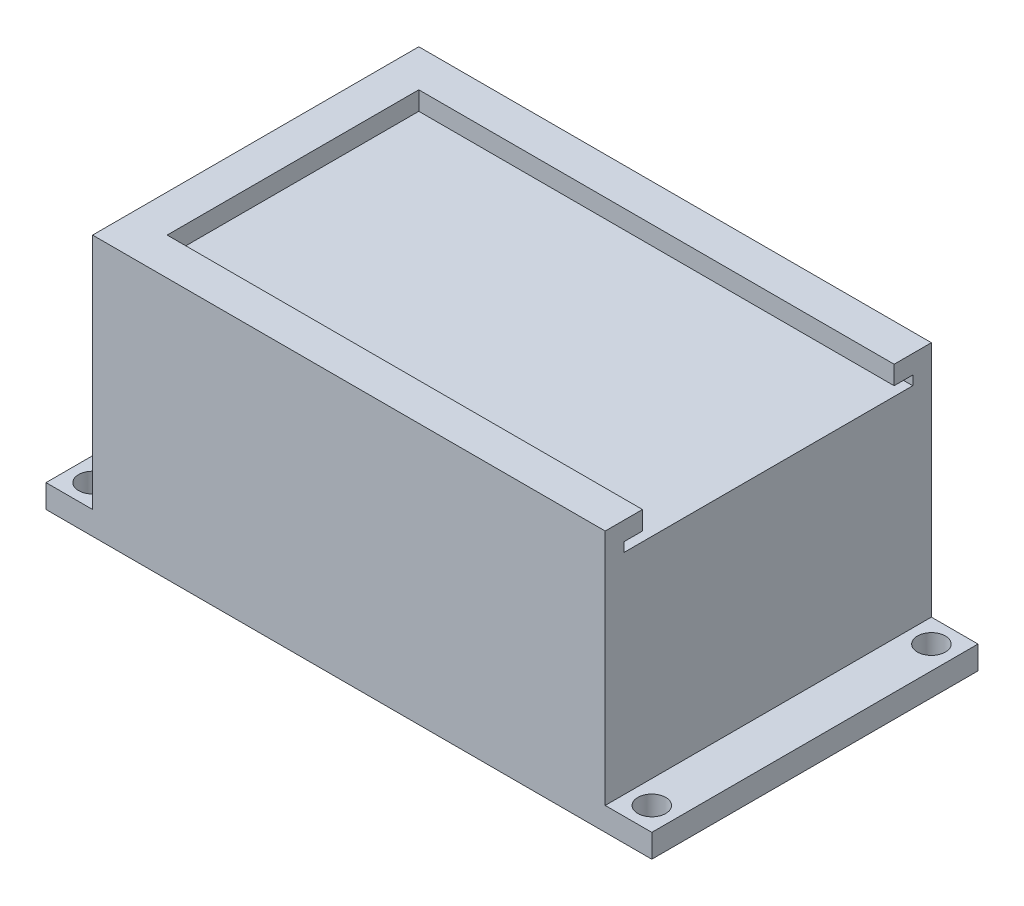
ISO-10303-21;
HEADER;
FILE_DESCRIPTION(('STEP AP214'),'2;1');
FILE_NAME('part.step','',(''),(''),'','','');
FILE_SCHEMA(('AUTOMOTIVE_DESIGN { 1 0 10303 214 1 1 1 1 }'));
ENDSEC;
DATA;
#1=APPLICATION_CONTEXT('core data for automotive mechanical design processes');
#2=APPLICATION_PROTOCOL_DEFINITION('international standard','automotive_design',2000,#1);
#3=PRODUCT_CONTEXT('',#1,'mechanical');
#4=PRODUCT('Part','Part','',(#3));
#5=PRODUCT_RELATED_PRODUCT_CATEGORY('part','',(#4));
#6=PRODUCT_DEFINITION_FORMATION('','',#4);
#7=PRODUCT_DEFINITION_CONTEXT('part definition',#1,'design');
#8=PRODUCT_DEFINITION('design','',#6,#7);
#9=PRODUCT_DEFINITION_SHAPE('','',#8);
#10=(LENGTH_UNIT() NAMED_UNIT(*) SI_UNIT(.MILLI.,.METRE.));
#11=(NAMED_UNIT(*) PLANE_ANGLE_UNIT() SI_UNIT($,.RADIAN.));
#12=(NAMED_UNIT(*) SI_UNIT($,.STERADIAN.) SOLID_ANGLE_UNIT());
#13=UNCERTAINTY_MEASURE_WITH_UNIT(LENGTH_MEASURE(1.E-05),#10,'distance_accuracy_value','');
#14=(GEOMETRIC_REPRESENTATION_CONTEXT(3) GLOBAL_UNCERTAINTY_ASSIGNED_CONTEXT((#13)) GLOBAL_UNIT_ASSIGNED_CONTEXT((#10,
#11,#12)) REPRESENTATION_CONTEXT('',''));
#15=CARTESIAN_POINT('',(0.,0.,0.));
#16=DIRECTION('',(0.,0.,1.));
#17=DIRECTION('',(1.,0.,0.));
#18=AXIS2_PLACEMENT_3D('',#15,#16,#17);
#19=CARTESIAN_POINT('',(0.,63.5,0.));
#20=DIRECTION('',(0.,1.,0.));
#21=DIRECTION('',(0.,0.,1.));
#22=AXIS2_PLACEMENT_3D('',#19,#20,#21);
#23=PLANE('',#22);
#24=DIRECTION('',(0.,0.,-1.));
#25=VECTOR('',#24,1.);
#26=CARTESIAN_POINT('',(-147.32,63.5,0.));
#27=LINE('',#26,#25);
#28=CARTESIAN_POINT('',(-147.32,63.5,-5.08));
#29=VERTEX_POINT('',#28);
#30=CARTESIAN_POINT('',(-147.32,63.5,-83.82));
#31=VERTEX_POINT('',#30);
#32=EDGE_CURVE('E53',#29,#31,#27,.T.);
#33=ORIENTED_EDGE('',*,*,#32,.F.);
#34=DIRECTION('',(1.,0.,0.));
#35=VECTOR('',#34,1.);
#36=CARTESIAN_POINT('',(0.,63.5,-5.08));
#37=LINE('',#36,#35);
#38=CARTESIAN_POINT('',(-12.7,63.5,-5.08));
#39=VERTEX_POINT('',#38);
#40=EDGE_CURVE('E243',#29,#39,#37,.T.);
#41=ORIENTED_EDGE('',*,*,#40,.T.);
#42=DIRECTION('',(0.,0.,-1.));
#43=VECTOR('',#42,1.);
#44=CARTESIAN_POINT('',(-12.7,63.5,-88.9));
#45=LINE('',#44,#43);
#46=CARTESIAN_POINT('',(-12.7,63.5,-83.82));
#47=VERTEX_POINT('',#46);
#48=EDGE_CURVE('E294',#39,#47,#45,.T.);
#49=ORIENTED_EDGE('',*,*,#48,.T.);
#50=DIRECTION('',(1.,0.,0.));
#51=VECTOR('',#50,1.);
#52=CARTESIAN_POINT('',(0.,63.5,-83.82));
#53=LINE('',#52,#51);
#54=EDGE_CURVE('E58',#31,#47,#53,.T.);
#55=ORIENTED_EDGE('',*,*,#54,.F.);
#56=EDGE_LOOP('',(#33,#41,#49,#55));
#57=FACE_BOUND('',#56,.T.);
#58=ADVANCED_FACE('F38',(#57),#23,.T.);
#59=CARTESIAN_POINT('',(0.,6.35,0.));
#60=DIRECTION('',(0.,1.,0.));
#61=DIRECTION('',(0.,0.,1.));
#62=AXIS2_PLACEMENT_3D('',#59,#60,#61);
#63=PLANE('',#62);
#64=DIRECTION('',(0.,0.,1.));
#65=VECTOR('',#64,1.);
#66=CARTESIAN_POINT('',(-152.4,6.35,-88.9));
#67=LINE('',#66,#65);
#68=CARTESIAN_POINT('',(-152.4,6.35,-88.9));
#69=VERTEX_POINT('',#68);
#70=CARTESIAN_POINT('',(-152.4,6.35,0.));
#71=VERTEX_POINT('',#70);
#72=EDGE_CURVE('E287',#69,#71,#67,.T.);
#73=ORIENTED_EDGE('',*,*,#72,.F.);
#74=DIRECTION('',(-1.,0.,0.));
#75=VECTOR('',#74,1.);
#76=CARTESIAN_POINT('',(-165.1,6.35,-88.9));
#77=LINE('',#76,#75);
#78=CARTESIAN_POINT('',(-165.1,6.35,-88.9));
#79=VERTEX_POINT('',#78);
#80=EDGE_CURVE('E338',#69,#79,#77,.T.);
#81=ORIENTED_EDGE('',*,*,#80,.T.);
#82=DIRECTION('',(0.,0.,1.));
#83=VECTOR('',#82,1.);
#84=CARTESIAN_POINT('',(-165.1,6.35,-88.9));
#85=LINE('',#84,#83);
#86=CARTESIAN_POINT('',(-165.1,6.35,0.));
#87=VERTEX_POINT('',#86);
#88=EDGE_CURVE('E329',#79,#87,#85,.T.);
#89=ORIENTED_EDGE('',*,*,#88,.T.);
#90=DIRECTION('',(1.,0.,0.));
#91=VECTOR('',#90,1.);
#92=CARTESIAN_POINT('',(-165.1,6.35,0.));
#93=LINE('',#92,#91);
#94=EDGE_CURVE('E334',#87,#71,#93,.T.);
#95=ORIENTED_EDGE('',*,*,#94,.T.);
#96=EDGE_LOOP('',(#73,#81,#89,#95));
#97=FACE_BOUND('',#96,.T.);
#98=CARTESIAN_POINT('',(-158.75,6.35,-82.55));
#99=DIRECTION('',(0.,1.,0.));
#100=DIRECTION('',(0.,0.,1.));
#101=AXIS2_PLACEMENT_3D('',#98,#99,#100);
#102=CIRCLE('',#101,3.81000000000001);
#103=CARTESIAN_POINT('',(-158.75,6.35,-78.74));
#104=VERTEX_POINT('',#103);
#105=EDGE_CURVE('E317',#104,#104,#102,.T.);
#106=ORIENTED_EDGE('',*,*,#105,.F.);
#107=EDGE_LOOP('',(#106));
#108=FACE_BOUND('',#107,.T.);
#109=CARTESIAN_POINT('',(-158.75,6.35,-6.35));
#110=DIRECTION('',(0.,1.,0.));
#111=DIRECTION('',(0.,0.,1.));
#112=AXIS2_PLACEMENT_3D('',#109,#110,#111);
#113=CIRCLE('',#112,3.81000000000001);
#114=CARTESIAN_POINT('',(-158.75,6.35,-2.53999999999999));
#115=VERTEX_POINT('',#114);
#116=EDGE_CURVE('E323',#115,#115,#113,.T.);
#117=ORIENTED_EDGE('',*,*,#116,.F.);
#118=EDGE_LOOP('',(#117));
#119=FACE_BOUND('',#118,.T.);
#120=ADVANCED_FACE('F372',(#97,#108,#119),#63,.T.);
#121=DIRECTION('',(0.,0.,-1.));
#122=VECTOR('',#121,1.);
#123=CARTESIAN_POINT('',(-12.7,6.35,-88.9));
#124=LINE('',#123,#122);
#125=CARTESIAN_POINT('',(-12.7,6.35,0.));
#126=VERTEX_POINT('',#125);
#127=CARTESIAN_POINT('',(-12.7,6.35,-88.9));
#128=VERTEX_POINT('',#127);
#129=EDGE_CURVE('E182',#126,#128,#124,.T.);
#130=ORIENTED_EDGE('',*,*,#129,.F.);
#131=CARTESIAN_POINT('',(0.,6.35,0.));
#132=VERTEX_POINT('',#131);
#133=EDGE_CURVE('E332',#126,#132,#93,.T.);
#134=ORIENTED_EDGE('',*,*,#133,.T.);
#135=DIRECTION('',(0.,0.,-1.));
#136=VECTOR('',#135,1.);
#137=CARTESIAN_POINT('',(0.,6.35,-88.9));
#138=LINE('',#137,#136);
#139=CARTESIAN_POINT('',(0.,6.35,-88.9));
#140=VERTEX_POINT('',#139);
#141=EDGE_CURVE('E336',#132,#140,#138,.T.);
#142=ORIENTED_EDGE('',*,*,#141,.T.);
#143=EDGE_CURVE('E339',#140,#128,#77,.T.);
#144=ORIENTED_EDGE('',*,*,#143,.T.);
#145=EDGE_LOOP('',(#130,#134,#142,#144));
#146=FACE_BOUND('',#145,.T.);
#147=CARTESIAN_POINT('',(-6.35,6.35,-82.55));
#148=DIRECTION('',(0.,1.,0.));
#149=DIRECTION('',(0.,0.,1.));
#150=AXIS2_PLACEMENT_3D('',#147,#148,#149);
#151=CIRCLE('',#150,3.81);
#152=CARTESIAN_POINT('',(-6.35,6.35,-78.74));
#153=VERTEX_POINT('',#152);
#154=EDGE_CURVE('E311',#153,#153,#151,.T.);
#155=ORIENTED_EDGE('',*,*,#154,.F.);
#156=EDGE_LOOP('',(#155));
#157=FACE_BOUND('',#156,.T.);
#158=CARTESIAN_POINT('',(-6.34999999999999,6.35,-6.35));
#159=DIRECTION('',(0.,1.,0.));
#160=DIRECTION('',(0.,0.,1.));
#161=AXIS2_PLACEMENT_3D('',#158,#159,#160);
#162=CIRCLE('',#161,3.81);
#163=CARTESIAN_POINT('',(-6.34999999999999,6.35,-2.54));
#164=VERTEX_POINT('',#163);
#165=EDGE_CURVE('E305',#164,#164,#162,.T.);
#166=ORIENTED_EDGE('',*,*,#165,.F.);
#167=EDGE_LOOP('',(#166));
#168=FACE_BOUND('',#167,.T.);
#169=ADVANCED_FACE('F410',(#146,#157,#168),#63,.T.);
#170=CARTESIAN_POINT('',(0.,0.,0.));
#171=DIRECTION('',(0.,1.,0.));
#172=DIRECTION('',(0.,0.,1.));
#173=AXIS2_PLACEMENT_3D('',#170,#171,#172);
#174=PLANE('',#173);
#175=DIRECTION('',(-1.,0.,0.));
#176=VECTOR('',#175,1.);
#177=CARTESIAN_POINT('',(-25.4,0.,-12.7));
#178=LINE('',#177,#176);
#179=CARTESIAN_POINT('',(-25.4,0.,-12.7));
#180=VERTEX_POINT('',#179);
#181=CARTESIAN_POINT('',(-139.7,0.,-12.7));
#182=VERTEX_POINT('',#181);
#183=EDGE_CURVE('E277',#180,#182,#178,.T.);
#184=ORIENTED_EDGE('',*,*,#183,.F.);
#185=DIRECTION('',(0.,0.,1.));
#186=VECTOR('',#185,1.);
#187=CARTESIAN_POINT('',(-25.4,0.,-76.2));
#188=LINE('',#187,#186);
#189=CARTESIAN_POINT('',(-25.4,0.,-76.2));
#190=VERTEX_POINT('',#189);
#191=EDGE_CURVE('E261',#190,#180,#188,.T.);
#192=ORIENTED_EDGE('',*,*,#191,.F.);
#193=DIRECTION('',(1.,0.,0.));
#194=VECTOR('',#193,1.);
#195=CARTESIAN_POINT('',(-25.4,0.,-76.2));
#196=LINE('',#195,#194);
#197=CARTESIAN_POINT('',(-139.7,0.,-76.2));
#198=VERTEX_POINT('',#197);
#199=EDGE_CURVE('E266',#198,#190,#196,.T.);
#200=ORIENTED_EDGE('',*,*,#199,.F.);
#201=DIRECTION('',(0.,0.,-1.));
#202=VECTOR('',#201,1.);
#203=CARTESIAN_POINT('',(-139.7,0.,-76.2));
#204=LINE('',#203,#202);
#205=EDGE_CURVE('E280',#182,#198,#204,.T.);
#206=ORIENTED_EDGE('',*,*,#205,.F.);
#207=EDGE_LOOP('',(#184,#192,#200,#206));
#208=FACE_BOUND('',#207,.T.);
#209=DIRECTION('',(0.,0.,1.));
#210=VECTOR('',#209,1.);
#211=CARTESIAN_POINT('',(-165.1,0.,-88.9));
#212=LINE('',#211,#210);
#213=CARTESIAN_POINT('',(-165.1,0.,-88.9));
#214=VERTEX_POINT('',#213);
#215=CARTESIAN_POINT('',(-165.1,0.,0.));
#216=VERTEX_POINT('',#215);
#217=EDGE_CURVE('E326',#214,#216,#212,.T.);
#218=ORIENTED_EDGE('',*,*,#217,.F.);
#219=DIRECTION('',(-1.,0.,0.));
#220=VECTOR('',#219,1.);
#221=CARTESIAN_POINT('',(-165.1,0.,-88.9));
#222=LINE('',#221,#220);
#223=CARTESIAN_POINT('',(0.,0.,-88.9));
#224=VERTEX_POINT('',#223);
#225=EDGE_CURVE('E333',#224,#214,#222,.T.);
#226=ORIENTED_EDGE('',*,*,#225,.F.);
#227=DIRECTION('',(0.,0.,-1.));
#228=VECTOR('',#227,1.);
#229=CARTESIAN_POINT('',(0.,0.,-88.9));
#230=LINE('',#229,#228);
#231=CARTESIAN_POINT('',(0.,0.,0.));
#232=VERTEX_POINT('',#231);
#233=EDGE_CURVE('E346',#232,#224,#230,.T.);
#234=ORIENTED_EDGE('',*,*,#233,.F.);
#235=DIRECTION('',(1.,0.,0.));
#236=VECTOR('',#235,1.);
#237=CARTESIAN_POINT('',(-165.1,0.,0.));
#238=LINE('',#237,#236);
#239=EDGE_CURVE('E344',#216,#232,#238,.T.);
#240=ORIENTED_EDGE('',*,*,#239,.F.);
#241=EDGE_LOOP('',(#218,#226,#234,#240));
#242=FACE_BOUND('',#241,.T.);
#243=CARTESIAN_POINT('',(-158.75,0.,-6.35));
#244=DIRECTION('',(0.,1.,0.));
#245=DIRECTION('',(0.,0.,1.));
#246=AXIS2_PLACEMENT_3D('',#243,#244,#245);
#247=CIRCLE('',#246,3.81000000000001);
#248=CARTESIAN_POINT('',(-158.75,0.,-2.53999999999999));
#249=VERTEX_POINT('',#248);
#250=EDGE_CURVE('E320',#249,#249,#247,.T.);
#251=ORIENTED_EDGE('',*,*,#250,.T.);
#252=EDGE_LOOP('',(#251));
#253=FACE_BOUND('',#252,.T.);
#254=CARTESIAN_POINT('',(-158.75,0.,-82.55));
#255=DIRECTION('',(0.,1.,0.));
#256=DIRECTION('',(0.,0.,1.));
#257=AXIS2_PLACEMENT_3D('',#254,#255,#256);
#258=CIRCLE('',#257,3.81000000000001);
#259=CARTESIAN_POINT('',(-158.75,0.,-78.74));
#260=VERTEX_POINT('',#259);
#261=EDGE_CURVE('E314',#260,#260,#258,.T.);
#262=ORIENTED_EDGE('',*,*,#261,.T.);
#263=EDGE_LOOP('',(#262));
#264=FACE_BOUND('',#263,.T.);
#265=CARTESIAN_POINT('',(-6.35,0.,-82.55));
#266=DIRECTION('',(0.,1.,0.));
#267=DIRECTION('',(0.,0.,1.));
#268=AXIS2_PLACEMENT_3D('',#265,#266,#267);
#269=CIRCLE('',#268,3.81);
#270=CARTESIAN_POINT('',(-6.35,0.,-78.74));
#271=VERTEX_POINT('',#270);
#272=EDGE_CURVE('E308',#271,#271,#269,.T.);
#273=ORIENTED_EDGE('',*,*,#272,.T.);
#274=EDGE_LOOP('',(#273));
#275=FACE_BOUND('',#274,.T.);
#276=CARTESIAN_POINT('',(-6.34999999999999,0.,-6.35));
#277=DIRECTION('',(0.,1.,0.));
#278=DIRECTION('',(0.,0.,1.));
#279=AXIS2_PLACEMENT_3D('',#276,#277,#278);
#280=CIRCLE('',#279,3.81);
#281=CARTESIAN_POINT('',(-6.34999999999999,0.,-2.54));
#282=VERTEX_POINT('',#281);
#283=EDGE_CURVE('E304',#282,#282,#280,.T.);
#284=ORIENTED_EDGE('',*,*,#283,.T.);
#285=EDGE_LOOP('',(#284));
#286=FACE_BOUND('',#285,.T.);
#287=ADVANCED_FACE('F365',(#208,#242,#253,#264,#275,#286),#174,.F.);
#288=CARTESIAN_POINT('',(-165.1,6.35,-88.9));
#289=DIRECTION('',(1.,0.,0.));
#290=DIRECTION('',(0.,0.,-1.));
#291=AXIS2_PLACEMENT_3D('',#288,#289,#290);
#292=PLANE('',#291);
#293=ORIENTED_EDGE('',*,*,#217,.T.);
#294=DIRECTION('',(0.,-1.,0.));
#295=VECTOR('',#294,1.);
#296=CARTESIAN_POINT('',(-165.1,6.35,0.));
#297=LINE('',#296,#295);
#298=EDGE_CURVE('E11',#87,#216,#297,.T.);
#299=ORIENTED_EDGE('',*,*,#298,.F.);
#300=ORIENTED_EDGE('',*,*,#88,.F.);
#301=DIRECTION('',(0.,-1.,0.));
#302=VECTOR('',#301,1.);
#303=CARTESIAN_POINT('',(-165.1,6.35,-88.9));
#304=LINE('',#303,#302);
#305=EDGE_CURVE('E341',#79,#214,#304,.T.);
#306=ORIENTED_EDGE('',*,*,#305,.T.);
#307=EDGE_LOOP('',(#293,#299,#300,#306));
#308=FACE_BOUND('',#307,.T.);
#309=ADVANCED_FACE('F40',(#308),#292,.F.);
#310=CARTESIAN_POINT('',(-165.1,6.35,0.));
#311=DIRECTION('',(0.,0.,-1.));
#312=DIRECTION('',(-1.,0.,0.));
#313=AXIS2_PLACEMENT_3D('',#310,#311,#312);
#314=PLANE('',#313);
#315=ORIENTED_EDGE('',*,*,#239,.T.);
#316=DIRECTION('',(0.,-1.,0.));
#317=VECTOR('',#316,1.);
#318=CARTESIAN_POINT('',(0.,6.35,0.));
#319=LINE('',#318,#317);
#320=EDGE_CURVE('E46',#132,#232,#319,.T.);
#321=ORIENTED_EDGE('',*,*,#320,.F.);
#322=ORIENTED_EDGE('',*,*,#133,.F.);
#323=DIRECTION('',(0.,-1.,0.));
#324=VECTOR('',#323,1.);
#325=CARTESIAN_POINT('',(-12.7,63.5,0.));
#326=LINE('',#325,#324);
#327=CARTESIAN_POINT('',(-12.7,71.12,0.));
#328=VERTEX_POINT('',#327);
#329=EDGE_CURVE('E185',#328,#126,#326,.T.);
#330=ORIENTED_EDGE('',*,*,#329,.F.);
#331=DIRECTION('',(1.,0.,0.));
#332=VECTOR('',#331,1.);
#333=CARTESIAN_POINT('',(0.,71.12,0.));
#334=LINE('',#333,#332);
#335=CARTESIAN_POINT('',(-152.4,71.12,0.));
#336=VERTEX_POINT('',#335);
#337=EDGE_CURVE('E208',#336,#328,#334,.T.);
#338=ORIENTED_EDGE('',*,*,#337,.F.);
#339=DIRECTION('',(0.,-1.,0.));
#340=VECTOR('',#339,1.);
#341=CARTESIAN_POINT('',(-152.4,63.5,0.));
#342=LINE('',#341,#340);
#343=EDGE_CURVE('E301',#336,#71,#342,.T.);
#344=ORIENTED_EDGE('',*,*,#343,.T.);
#345=ORIENTED_EDGE('',*,*,#94,.F.);
#346=ORIENTED_EDGE('',*,*,#298,.T.);
#347=EDGE_LOOP('',(#315,#321,#322,#330,#338,#344,#345,#346));
#348=FACE_BOUND('',#347,.T.);
#349=ADVANCED_FACE('F376',(#348),#314,.F.);
#350=CARTESIAN_POINT('',(0.,6.35,-88.9));
#351=DIRECTION('',(-1.,0.,0.));
#352=DIRECTION('',(0.,0.,1.));
#353=AXIS2_PLACEMENT_3D('',#350,#351,#352);
#354=PLANE('',#353);
#355=ORIENTED_EDGE('',*,*,#233,.T.);
#356=DIRECTION('',(0.,-1.,0.));
#357=VECTOR('',#356,1.);
#358=CARTESIAN_POINT('',(0.,6.35,-88.9));
#359=LINE('',#358,#357);
#360=EDGE_CURVE('E351',#140,#224,#359,.T.);
#361=ORIENTED_EDGE('',*,*,#360,.F.);
#362=ORIENTED_EDGE('',*,*,#141,.F.);
#363=ORIENTED_EDGE('',*,*,#320,.T.);
#364=EDGE_LOOP('',(#355,#361,#362,#363));
#365=FACE_BOUND('',#364,.T.);
#366=ADVANCED_FACE('F358',(#365),#354,.F.);
#367=CARTESIAN_POINT('',(-165.1,6.35,-88.9));
#368=DIRECTION('',(0.,0.,1.));
#369=DIRECTION('',(1.,0.,0.));
#370=AXIS2_PLACEMENT_3D('',#367,#368,#369);
#371=PLANE('',#370);
#372=ORIENTED_EDGE('',*,*,#225,.T.);
#373=ORIENTED_EDGE('',*,*,#305,.F.);
#374=ORIENTED_EDGE('',*,*,#80,.F.);
#375=DIRECTION('',(0.,-1.,0.));
#376=VECTOR('',#375,1.);
#377=CARTESIAN_POINT('',(-152.4,63.5,-88.9));
#378=LINE('',#377,#376);
#379=CARTESIAN_POINT('',(-152.4,71.12,-88.9));
#380=VERTEX_POINT('',#379);
#381=EDGE_CURVE('E186',#380,#69,#378,.T.);
#382=ORIENTED_EDGE('',*,*,#381,.F.);
#383=DIRECTION('',(-1.,0.,0.));
#384=VECTOR('',#383,1.);
#385=CARTESIAN_POINT('',(0.,71.12,-88.9));
#386=LINE('',#385,#384);
#387=CARTESIAN_POINT('',(-12.7,71.12,-88.9));
#388=VERTEX_POINT('',#387);
#389=EDGE_CURVE('E189',#388,#380,#386,.T.);
#390=ORIENTED_EDGE('',*,*,#389,.F.);
#391=DIRECTION('',(0.,-1.,0.));
#392=VECTOR('',#391,1.);
#393=CARTESIAN_POINT('',(-12.7,63.5,-88.9));
#394=LINE('',#393,#392);
#395=EDGE_CURVE('E175',#388,#128,#394,.T.);
#396=ORIENTED_EDGE('',*,*,#395,.T.);
#397=ORIENTED_EDGE('',*,*,#143,.F.);
#398=ORIENTED_EDGE('',*,*,#360,.T.);
#399=EDGE_LOOP('',(#372,#373,#374,#382,#390,#396,#397,#398));
#400=FACE_BOUND('',#399,.T.);
#401=ADVANCED_FACE('F190',(#400),#371,.F.);
#402=CARTESIAN_POINT('',(-158.75,6.35,-6.35));
#403=DIRECTION('',(0.,-1.,0.));
#404=DIRECTION('',(0.,0.,-1.));
#405=AXIS2_PLACEMENT_3D('',#402,#403,#404);
#406=CYLINDRICAL_SURFACE('',#405,3.81000000000001);
#407=ORIENTED_EDGE('',*,*,#116,.T.);
#408=EDGE_LOOP('',(#407));
#409=FACE_BOUND('',#408,.T.);
#410=ORIENTED_EDGE('',*,*,#250,.F.);
#411=EDGE_LOOP('',(#410));
#412=FACE_BOUND('',#411,.T.);
#413=ADVANCED_FACE('F431',(#409,#412),#406,.F.);
#414=CARTESIAN_POINT('',(-158.75,6.35,-82.55));
#415=DIRECTION('',(0.,-1.,0.));
#416=DIRECTION('',(0.,0.,-1.));
#417=AXIS2_PLACEMENT_3D('',#414,#415,#416);
#418=CYLINDRICAL_SURFACE('',#417,3.81000000000001);
#419=ORIENTED_EDGE('',*,*,#105,.T.);
#420=EDGE_LOOP('',(#419));
#421=FACE_BOUND('',#420,.T.);
#422=ORIENTED_EDGE('',*,*,#261,.F.);
#423=EDGE_LOOP('',(#422));
#424=FACE_BOUND('',#423,.T.);
#425=ADVANCED_FACE('F427',(#421,#424),#418,.F.);
#426=CARTESIAN_POINT('',(-6.35,6.35,-82.55));
#427=DIRECTION('',(0.,-1.,0.));
#428=DIRECTION('',(0.,0.,-1.));
#429=AXIS2_PLACEMENT_3D('',#426,#427,#428);
#430=CYLINDRICAL_SURFACE('',#429,3.81);
#431=ORIENTED_EDGE('',*,*,#154,.T.);
#432=EDGE_LOOP('',(#431));
#433=FACE_BOUND('',#432,.T.);
#434=ORIENTED_EDGE('',*,*,#272,.F.);
#435=EDGE_LOOP('',(#434));
#436=FACE_BOUND('',#435,.T.);
#437=ADVANCED_FACE('F423',(#433,#436),#430,.F.);
#438=CARTESIAN_POINT('',(-6.34999999999999,6.35,-6.35));
#439=DIRECTION('',(0.,-1.,0.));
#440=DIRECTION('',(0.,0.,-1.));
#441=AXIS2_PLACEMENT_3D('',#438,#439,#440);
#442=CYLINDRICAL_SURFACE('',#441,3.81);
#443=ORIENTED_EDGE('',*,*,#165,.T.);
#444=EDGE_LOOP('',(#443));
#445=FACE_BOUND('',#444,.T.);
#446=ORIENTED_EDGE('',*,*,#283,.F.);
#447=EDGE_LOOP('',(#446));
#448=FACE_BOUND('',#447,.T.);
#449=ADVANCED_FACE('F420',(#445,#448),#442,.F.);
#450=CARTESIAN_POINT('',(-152.4,63.5,-88.9));
#451=DIRECTION('',(1.,0.,0.));
#452=DIRECTION('',(0.,0.,-1.));
#453=AXIS2_PLACEMENT_3D('',#450,#451,#452);
#454=PLANE('',#453);
#455=ORIENTED_EDGE('',*,*,#72,.T.);
#456=ORIENTED_EDGE('',*,*,#343,.F.);
#457=DIRECTION('',(0.,0.,1.));
#458=VECTOR('',#457,1.);
#459=CARTESIAN_POINT('',(-152.4,71.12,0.));
#460=LINE('',#459,#458);
#461=EDGE_CURVE('E196',#380,#336,#460,.T.);
#462=ORIENTED_EDGE('',*,*,#461,.F.);
#463=ORIENTED_EDGE('',*,*,#381,.T.);
#464=EDGE_LOOP('',(#455,#456,#462,#463));
#465=FACE_BOUND('',#464,.T.);
#466=ADVANCED_FACE('F375',(#465),#454,.F.);
#467=CARTESIAN_POINT('',(-12.7,63.5,-88.9));
#468=DIRECTION('',(-1.,0.,0.));
#469=DIRECTION('',(0.,0.,1.));
#470=AXIS2_PLACEMENT_3D('',#467,#468,#469);
#471=PLANE('',#470);
#472=ORIENTED_EDGE('',*,*,#129,.T.);
#473=ORIENTED_EDGE('',*,*,#395,.F.);
#474=DIRECTION('',(0.,0.,-1.));
#475=VECTOR('',#474,1.);
#476=CARTESIAN_POINT('',(-12.7,71.12,0.));
#477=LINE('',#476,#475);
#478=CARTESIAN_POINT('',(-12.7,71.12,-78.74));
#479=VERTEX_POINT('',#478);
#480=EDGE_CURVE('E180',#479,#388,#477,.T.);
#481=ORIENTED_EDGE('',*,*,#480,.F.);
#482=DIRECTION('',(0.,-1.,0.));
#483=VECTOR('',#482,1.);
#484=CARTESIAN_POINT('',(-12.7,71.12,-78.74));
#485=LINE('',#484,#483);
#486=CARTESIAN_POINT('',(-12.7,66.04,-78.74));
#487=VERTEX_POINT('',#486);
#488=EDGE_CURVE('E222',#479,#487,#485,.T.);
#489=ORIENTED_EDGE('',*,*,#488,.T.);
#490=DIRECTION('',(0.,0.,-1.));
#491=VECTOR('',#490,1.);
#492=CARTESIAN_POINT('',(-12.7,66.04,0.));
#493=LINE('',#492,#491);
#494=CARTESIAN_POINT('',(-12.7,66.04,-83.82));
#495=VERTEX_POINT('',#494);
#496=EDGE_CURVE('E223',#487,#495,#493,.T.);
#497=ORIENTED_EDGE('',*,*,#496,.T.);
#498=DIRECTION('',(0.,-1.,0.));
#499=VECTOR('',#498,1.);
#500=CARTESIAN_POINT('',(-12.7,66.04,-83.82));
#501=LINE('',#500,#499);
#502=EDGE_CURVE('E256',#495,#47,#501,.T.);
#503=ORIENTED_EDGE('',*,*,#502,.T.);
#504=ORIENTED_EDGE('',*,*,#48,.F.);
#505=DIRECTION('',(0.,-1.,0.));
#506=VECTOR('',#505,1.);
#507=CARTESIAN_POINT('',(-12.7,66.04,-5.08));
#508=LINE('',#507,#506);
#509=CARTESIAN_POINT('',(-12.7,66.04,-5.08));
#510=VERTEX_POINT('',#509);
#511=EDGE_CURVE('E253',#510,#39,#508,.T.);
#512=ORIENTED_EDGE('',*,*,#511,.F.);
#513=CARTESIAN_POINT('',(-12.7,66.04,-10.16));
#514=VERTEX_POINT('',#513);
#515=EDGE_CURVE('E226',#510,#514,#493,.T.);
#516=ORIENTED_EDGE('',*,*,#515,.T.);
#517=DIRECTION('',(0.,-1.,0.));
#518=VECTOR('',#517,1.);
#519=CARTESIAN_POINT('',(-12.7,71.12,-10.16));
#520=LINE('',#519,#518);
#521=CARTESIAN_POINT('',(-12.7,71.12,-10.16));
#522=VERTEX_POINT('',#521);
#523=EDGE_CURVE('E237',#522,#514,#520,.T.);
#524=ORIENTED_EDGE('',*,*,#523,.F.);
#525=EDGE_CURVE('E204',#328,#522,#477,.T.);
#526=ORIENTED_EDGE('',*,*,#525,.F.);
#527=ORIENTED_EDGE('',*,*,#329,.T.);
#528=EDGE_LOOP('',(#472,#473,#481,#489,#497,#503,#504,#512,#516,#524,#526,#527));
#529=FACE_BOUND('',#528,.T.);
#530=ADVANCED_FACE('F177',(#529),#471,.F.);
#531=CARTESIAN_POINT('',(-25.4,50.8,-76.2));
#532=DIRECTION('',(1.,0.,0.));
#533=DIRECTION('',(0.,0.,-1.));
#534=AXIS2_PLACEMENT_3D('',#531,#532,#533);
#535=PLANE('',#534);
#536=ORIENTED_EDGE('',*,*,#191,.T.);
#537=DIRECTION('',(0.,-1.,0.));
#538=VECTOR('',#537,1.);
#539=CARTESIAN_POINT('',(-25.4,50.8,-12.7));
#540=LINE('',#539,#538);
#541=CARTESIAN_POINT('',(-25.4,50.8,-12.7));
#542=VERTEX_POINT('',#541);
#543=EDGE_CURVE('E275',#542,#180,#540,.T.);
#544=ORIENTED_EDGE('',*,*,#543,.F.);
#545=DIRECTION('',(0.,0.,1.));
#546=VECTOR('',#545,1.);
#547=CARTESIAN_POINT('',(-25.4,50.8,-76.2));
#548=LINE('',#547,#546);
#549=CARTESIAN_POINT('',(-25.4,50.8,-76.2));
#550=VERTEX_POINT('',#549);
#551=EDGE_CURVE('E262',#550,#542,#548,.T.);
#552=ORIENTED_EDGE('',*,*,#551,.F.);
#553=DIRECTION('',(0.,-1.,0.));
#554=VECTOR('',#553,1.);
#555=CARTESIAN_POINT('',(-25.4,50.8,-76.2));
#556=LINE('',#555,#554);
#557=EDGE_CURVE('E285',#550,#190,#556,.T.);
#558=ORIENTED_EDGE('',*,*,#557,.T.);
#559=EDGE_LOOP('',(#536,#544,#552,#558));
#560=FACE_BOUND('',#559,.T.);
#561=ADVANCED_FACE('F414',(#560),#535,.F.);
#562=CARTESIAN_POINT('',(-25.4,50.8,-76.2));
#563=DIRECTION('',(0.,0.,-1.));
#564=DIRECTION('',(-1.,0.,0.));
#565=AXIS2_PLACEMENT_3D('',#562,#563,#564);
#566=PLANE('',#565);
#567=ORIENTED_EDGE('',*,*,#199,.T.);
#568=ORIENTED_EDGE('',*,*,#557,.F.);
#569=DIRECTION('',(1.,0.,0.));
#570=VECTOR('',#569,1.);
#571=CARTESIAN_POINT('',(-25.4,50.8,-76.2));
#572=LINE('',#571,#570);
#573=CARTESIAN_POINT('',(-139.7,50.8,-76.2));
#574=VERTEX_POINT('',#573);
#575=EDGE_CURVE('E272',#574,#550,#572,.T.);
#576=ORIENTED_EDGE('',*,*,#575,.F.);
#577=DIRECTION('',(0.,-1.,0.));
#578=VECTOR('',#577,1.);
#579=CARTESIAN_POINT('',(-139.7,50.8,-76.2));
#580=LINE('',#579,#578);
#581=EDGE_CURVE('E288',#574,#198,#580,.T.);
#582=ORIENTED_EDGE('',*,*,#581,.T.);
#583=EDGE_LOOP('',(#567,#568,#576,#582));
#584=FACE_BOUND('',#583,.T.);
#585=ADVANCED_FACE('F601',(#584),#566,.F.);
#586=CARTESIAN_POINT('',(-139.7,50.8,-76.2));
#587=DIRECTION('',(-1.,0.,0.));
#588=DIRECTION('',(0.,0.,1.));
#589=AXIS2_PLACEMENT_3D('',#586,#587,#588);
#590=PLANE('',#589);
#591=ORIENTED_EDGE('',*,*,#205,.T.);
#592=ORIENTED_EDGE('',*,*,#581,.F.);
#593=DIRECTION('',(0.,0.,-1.));
#594=VECTOR('',#593,1.);
#595=CARTESIAN_POINT('',(-139.7,50.8,-76.2));
#596=LINE('',#595,#594);
#597=CARTESIAN_POINT('',(-139.7,50.8,-12.7));
#598=VERTEX_POINT('',#597);
#599=EDGE_CURVE('E269',#598,#574,#596,.T.);
#600=ORIENTED_EDGE('',*,*,#599,.F.);
#601=DIRECTION('',(0.,-1.,0.));
#602=VECTOR('',#601,1.);
#603=CARTESIAN_POINT('',(-139.7,50.8,-12.7));
#604=LINE('',#603,#602);
#605=EDGE_CURVE('E290',#598,#182,#604,.T.);
#606=ORIENTED_EDGE('',*,*,#605,.T.);
#607=EDGE_LOOP('',(#591,#592,#600,#606));
#608=FACE_BOUND('',#607,.T.);
#609=ADVANCED_FACE('F604',(#608),#590,.F.);
#610=CARTESIAN_POINT('',(-25.4,50.8,-12.7));
#611=DIRECTION('',(0.,0.,1.));
#612=DIRECTION('',(1.,0.,0.));
#613=AXIS2_PLACEMENT_3D('',#610,#611,#612);
#614=PLANE('',#613);
#615=ORIENTED_EDGE('',*,*,#183,.T.);
#616=ORIENTED_EDGE('',*,*,#605,.F.);
#617=DIRECTION('',(-1.,0.,0.));
#618=VECTOR('',#617,1.);
#619=CARTESIAN_POINT('',(-25.4,50.8,-12.7));
#620=LINE('',#619,#618);
#621=EDGE_CURVE('E265',#542,#598,#620,.T.);
#622=ORIENTED_EDGE('',*,*,#621,.F.);
#623=ORIENTED_EDGE('',*,*,#543,.T.);
#624=EDGE_LOOP('',(#615,#616,#622,#623));
#625=FACE_BOUND('',#624,.T.);
#626=ADVANCED_FACE('F599',(#625),#614,.F.);
#627=CARTESIAN_POINT('',(0.,50.8,0.));
#628=DIRECTION('',(0.,-1.,0.));
#629=DIRECTION('',(0.,0.,-1.));
#630=AXIS2_PLACEMENT_3D('',#627,#628,#629);
#631=PLANE('',#630);
#632=ORIENTED_EDGE('',*,*,#551,.T.);
#633=ORIENTED_EDGE('',*,*,#621,.T.);
#634=ORIENTED_EDGE('',*,*,#599,.T.);
#635=ORIENTED_EDGE('',*,*,#575,.T.);
#636=EDGE_LOOP('',(#632,#633,#634,#635));
#637=FACE_BOUND('',#636,.T.);
#638=ADVANCED_FACE('F531',(#637),#631,.T.);
#639=CARTESIAN_POINT('',(-147.32,66.04,0.));
#640=DIRECTION('',(-1.,0.,0.));
#641=DIRECTION('',(0.,0.,1.));
#642=AXIS2_PLACEMENT_3D('',#639,#640,#641);
#643=PLANE('',#642);
#644=ORIENTED_EDGE('',*,*,#32,.T.);
#645=DIRECTION('',(0.,-1.,0.));
#646=VECTOR('',#645,1.);
#647=CARTESIAN_POINT('',(-147.32,66.04,-83.82));
#648=LINE('',#647,#646);
#649=CARTESIAN_POINT('',(-147.32,66.04,-83.82));
#650=VERTEX_POINT('',#649);
#651=EDGE_CURVE('E259',#650,#31,#648,.T.);
#652=ORIENTED_EDGE('',*,*,#651,.F.);
#653=DIRECTION('',(0.,0.,-1.));
#654=VECTOR('',#653,1.);
#655=CARTESIAN_POINT('',(-147.32,66.04,0.));
#656=LINE('',#655,#654);
#657=CARTESIAN_POINT('',(-147.32,66.04,-5.08));
#658=VERTEX_POINT('',#657);
#659=EDGE_CURVE('E240',#658,#650,#656,.T.);
#660=ORIENTED_EDGE('',*,*,#659,.F.);
#661=DIRECTION('',(0.,-1.,0.));
#662=VECTOR('',#661,1.);
#663=CARTESIAN_POINT('',(-147.32,66.04,-5.08));
#664=LINE('',#663,#662);
#665=EDGE_CURVE('E248',#658,#29,#664,.T.);
#666=ORIENTED_EDGE('',*,*,#665,.T.);
#667=EDGE_LOOP('',(#644,#652,#660,#666));
#668=FACE_BOUND('',#667,.T.);
#669=ADVANCED_FACE('F399',(#668),#643,.F.);
#670=CARTESIAN_POINT('',(0.,66.04,-83.82));
#671=DIRECTION('',(0.,0.,-1.));
#672=DIRECTION('',(-1.,0.,0.));
#673=AXIS2_PLACEMENT_3D('',#670,#671,#672);
#674=PLANE('',#673);
#675=ORIENTED_EDGE('',*,*,#54,.T.);
#676=ORIENTED_EDGE('',*,*,#502,.F.);
#677=DIRECTION('',(1.,0.,0.));
#678=VECTOR('',#677,1.);
#679=CARTESIAN_POINT('',(0.,66.04,-83.82));
#680=LINE('',#679,#678);
#681=EDGE_CURVE('E242',#650,#495,#680,.T.);
#682=ORIENTED_EDGE('',*,*,#681,.F.);
#683=ORIENTED_EDGE('',*,*,#651,.T.);
#684=EDGE_LOOP('',(#675,#676,#682,#683));
#685=FACE_BOUND('',#684,.T.);
#686=ADVANCED_FACE('F397',(#685),#674,.F.);
#687=CARTESIAN_POINT('',(0.,66.04,-5.08));
#688=DIRECTION('',(0.,0.,-1.));
#689=DIRECTION('',(-1.,0.,0.));
#690=AXIS2_PLACEMENT_3D('',#687,#688,#689);
#691=PLANE('',#690);
#692=ORIENTED_EDGE('',*,*,#40,.F.);
#693=ORIENTED_EDGE('',*,*,#665,.F.);
#694=DIRECTION('',(1.,0.,0.));
#695=VECTOR('',#694,1.);
#696=CARTESIAN_POINT('',(0.,66.04,-5.08));
#697=LINE('',#696,#695);
#698=EDGE_CURVE('E245',#658,#510,#697,.T.);
#699=ORIENTED_EDGE('',*,*,#698,.T.);
#700=ORIENTED_EDGE('',*,*,#511,.T.);
#701=EDGE_LOOP('',(#692,#693,#699,#700));
#702=FACE_BOUND('',#701,.T.);
#703=ADVANCED_FACE('F403',(#702),#691,.T.);
#704=CARTESIAN_POINT('',(0.,66.04,0.));
#705=DIRECTION('',(0.,1.,0.));
#706=DIRECTION('',(0.,0.,1.));
#707=AXIS2_PLACEMENT_3D('',#704,#705,#706);
#708=PLANE('',#707);
#709=ORIENTED_EDGE('',*,*,#659,.T.);
#710=ORIENTED_EDGE('',*,*,#681,.T.);
#711=ORIENTED_EDGE('',*,*,#496,.F.);
#712=DIRECTION('',(1.,0.,0.));
#713=VECTOR('',#712,1.);
#714=CARTESIAN_POINT('',(0.,66.04,-78.74));
#715=LINE('',#714,#713);
#716=CARTESIAN_POINT('',(-142.24,66.04,-78.74));
#717=VERTEX_POINT('',#716);
#718=EDGE_CURVE('E202',#717,#487,#715,.T.);
#719=ORIENTED_EDGE('',*,*,#718,.F.);
#720=DIRECTION('',(0.,0.,-1.));
#721=VECTOR('',#720,1.);
#722=CARTESIAN_POINT('',(-142.24,66.04,0.));
#723=LINE('',#722,#721);
#724=CARTESIAN_POINT('',(-142.24,66.04,-10.16));
#725=VERTEX_POINT('',#724);
#726=EDGE_CURVE('E205',#725,#717,#723,.T.);
#727=ORIENTED_EDGE('',*,*,#726,.F.);
#728=DIRECTION('',(1.,0.,0.));
#729=VECTOR('',#728,1.);
#730=CARTESIAN_POINT('',(0.,66.04,-10.16));
#731=LINE('',#730,#729);
#732=EDGE_CURVE('E227',#725,#514,#731,.T.);
#733=ORIENTED_EDGE('',*,*,#732,.T.);
#734=ORIENTED_EDGE('',*,*,#515,.F.);
#735=ORIENTED_EDGE('',*,*,#698,.F.);
#736=EDGE_LOOP('',(#709,#710,#711,#719,#727,#733,#734,#735));
#737=FACE_BOUND('',#736,.T.);
#738=ADVANCED_FACE('F392',(#737),#708,.F.);
#739=CARTESIAN_POINT('',(0.,71.12,-10.16));
#740=DIRECTION('',(0.,0.,-1.));
#741=DIRECTION('',(-1.,0.,0.));
#742=AXIS2_PLACEMENT_3D('',#739,#740,#741);
#743=PLANE('',#742);
#744=ORIENTED_EDGE('',*,*,#732,.F.);
#745=DIRECTION('',(0.,-1.,0.));
#746=VECTOR('',#745,1.);
#747=CARTESIAN_POINT('',(-142.24,71.12,-10.16));
#748=LINE('',#747,#746);
#749=CARTESIAN_POINT('',(-142.24,71.12,-10.16));
#750=VERTEX_POINT('',#749);
#751=EDGE_CURVE('E235',#750,#725,#748,.T.);
#752=ORIENTED_EDGE('',*,*,#751,.F.);
#753=DIRECTION('',(1.,0.,0.));
#754=VECTOR('',#753,1.);
#755=CARTESIAN_POINT('',(0.,71.12,-10.16));
#756=LINE('',#755,#754);
#757=EDGE_CURVE('E207',#750,#522,#756,.T.);
#758=ORIENTED_EDGE('',*,*,#757,.T.);
#759=ORIENTED_EDGE('',*,*,#523,.T.);
#760=EDGE_LOOP('',(#744,#752,#758,#759));
#761=FACE_BOUND('',#760,.T.);
#762=ADVANCED_FACE('F380',(#761),#743,.T.);
#763=CARTESIAN_POINT('',(-142.24,71.12,0.));
#764=DIRECTION('',(-1.,0.,0.));
#765=DIRECTION('',(0.,0.,1.));
#766=AXIS2_PLACEMENT_3D('',#763,#764,#765);
#767=PLANE('',#766);
#768=ORIENTED_EDGE('',*,*,#726,.T.);
#769=DIRECTION('',(0.,-1.,0.));
#770=VECTOR('',#769,1.);
#771=CARTESIAN_POINT('',(-142.24,71.12,-78.74));
#772=LINE('',#771,#770);
#773=CARTESIAN_POINT('',(-142.24,71.12,-78.74));
#774=VERTEX_POINT('',#773);
#775=EDGE_CURVE('E232',#774,#717,#772,.T.);
#776=ORIENTED_EDGE('',*,*,#775,.F.);
#777=DIRECTION('',(0.,0.,-1.));
#778=VECTOR('',#777,1.);
#779=CARTESIAN_POINT('',(-142.24,71.12,0.));
#780=LINE('',#779,#778);
#781=EDGE_CURVE('E214',#750,#774,#780,.T.);
#782=ORIENTED_EDGE('',*,*,#781,.F.);
#783=ORIENTED_EDGE('',*,*,#751,.T.);
#784=EDGE_LOOP('',(#768,#776,#782,#783));
#785=FACE_BOUND('',#784,.T.);
#786=ADVANCED_FACE('F384',(#785),#767,.F.);
#787=CARTESIAN_POINT('',(0.,71.12,-78.74));
#788=DIRECTION('',(0.,0.,-1.));
#789=DIRECTION('',(-1.,0.,0.));
#790=AXIS2_PLACEMENT_3D('',#787,#788,#789);
#791=PLANE('',#790);
#792=ORIENTED_EDGE('',*,*,#718,.T.);
#793=ORIENTED_EDGE('',*,*,#488,.F.);
#794=DIRECTION('',(1.,0.,0.));
#795=VECTOR('',#794,1.);
#796=CARTESIAN_POINT('',(0.,71.12,-78.74));
#797=LINE('',#796,#795);
#798=EDGE_CURVE('E200',#774,#479,#797,.T.);
#799=ORIENTED_EDGE('',*,*,#798,.F.);
#800=ORIENTED_EDGE('',*,*,#775,.T.);
#801=EDGE_LOOP('',(#792,#793,#799,#800));
#802=FACE_BOUND('',#801,.T.);
#803=ADVANCED_FACE('F388',(#802),#791,.F.);
#804=CARTESIAN_POINT('',(0.,71.12,0.));
#805=DIRECTION('',(0.,1.,0.));
#806=DIRECTION('',(0.,0.,1.));
#807=AXIS2_PLACEMENT_3D('',#804,#805,#806);
#808=PLANE('',#807);
#809=ORIENTED_EDGE('',*,*,#480,.T.);
#810=ORIENTED_EDGE('',*,*,#389,.T.);
#811=ORIENTED_EDGE('',*,*,#461,.T.);
#812=ORIENTED_EDGE('',*,*,#337,.T.);
#813=ORIENTED_EDGE('',*,*,#525,.T.);
#814=ORIENTED_EDGE('',*,*,#757,.F.);
#815=ORIENTED_EDGE('',*,*,#781,.T.);
#816=ORIENTED_EDGE('',*,*,#798,.T.);
#817=EDGE_LOOP('',(#809,#810,#811,#812,#813,#814,#815,#816));
#818=FACE_BOUND('',#817,.T.);
#819=ADVANCED_FACE('F198',(#818),#808,.T.);
#820=CLOSED_SHELL('',(#58,#120,#169,#287,#309,#349,#366,#401,#413,#425,#437,#449,#466,#530,#561,
#585,#609,#626,#638,#669,#686,#703,#738,#762,#786,#803,#819));
#821=MANIFOLD_SOLID_BREP('B2',#820);
#822=ADVANCED_BREP_SHAPE_REPRESENTATION('',(#18,#821),#14);
#823=SHAPE_DEFINITION_REPRESENTATION(#9,#822);
ENDSEC;
END-ISO-10303-21;
